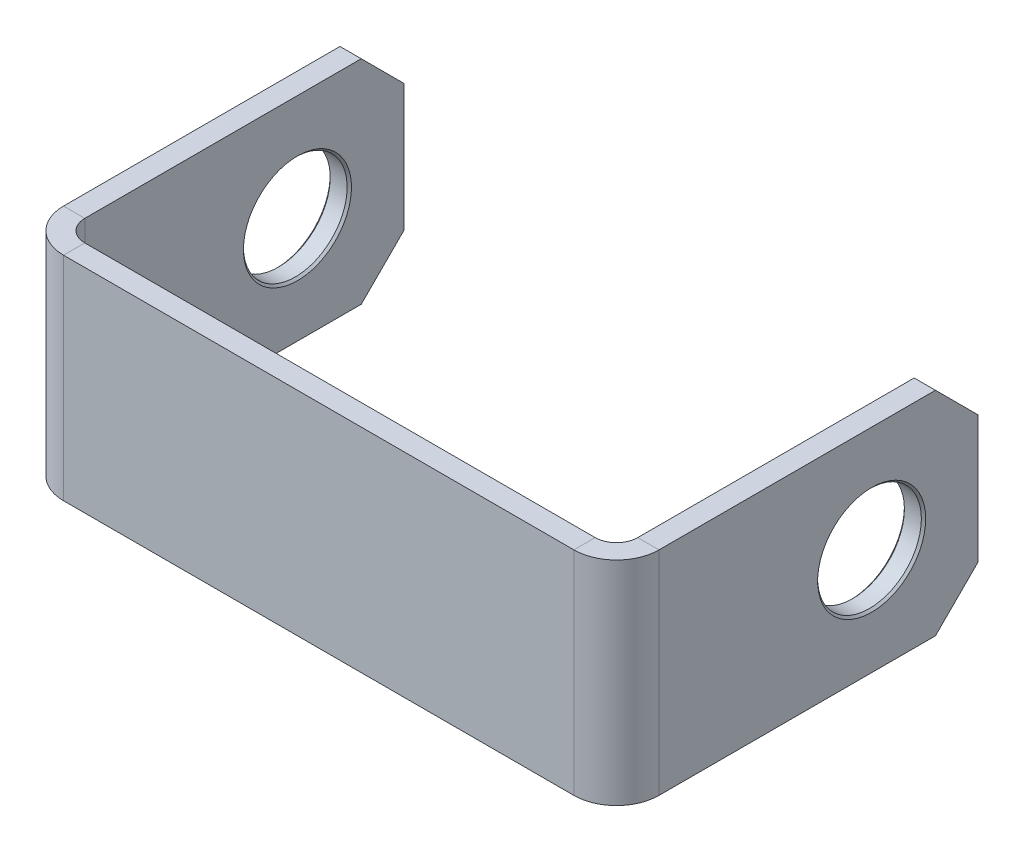
ISO-10303-21;
HEADER;
FILE_DESCRIPTION(('STEP AP214'),'2;1');
FILE_NAME('part.step','',(''),(''),'','','');
FILE_SCHEMA(('AUTOMOTIVE_DESIGN { 1 0 10303 214 1 1 1 1 }'));
ENDSEC;
DATA;
#1=APPLICATION_CONTEXT('core data for automotive mechanical design processes');
#2=APPLICATION_PROTOCOL_DEFINITION('international standard','automotive_design',2000,#1);
#3=PRODUCT_CONTEXT('',#1,'mechanical');
#4=PRODUCT('Part','Part','',(#3));
#5=PRODUCT_RELATED_PRODUCT_CATEGORY('part','',(#4));
#6=PRODUCT_DEFINITION_FORMATION('','',#4);
#7=PRODUCT_DEFINITION_CONTEXT('part definition',#1,'design');
#8=PRODUCT_DEFINITION('design','',#6,#7);
#9=PRODUCT_DEFINITION_SHAPE('','',#8);
#10=(LENGTH_UNIT() NAMED_UNIT(*) SI_UNIT(.MILLI.,.METRE.));
#11=(NAMED_UNIT(*) PLANE_ANGLE_UNIT() SI_UNIT($,.RADIAN.));
#12=(NAMED_UNIT(*) SI_UNIT($,.STERADIAN.) SOLID_ANGLE_UNIT());
#13=UNCERTAINTY_MEASURE_WITH_UNIT(LENGTH_MEASURE(1.E-05),#10,'distance_accuracy_value','');
#14=(GEOMETRIC_REPRESENTATION_CONTEXT(3) GLOBAL_UNCERTAINTY_ASSIGNED_CONTEXT((#13)) GLOBAL_UNIT_ASSIGNED_CONTEXT((#10,
#11,#12)) REPRESENTATION_CONTEXT('',''));
#15=CARTESIAN_POINT('',(0.,0.,0.));
#16=DIRECTION('',(0.,0.,1.));
#17=DIRECTION('',(1.,0.,0.));
#18=AXIS2_PLACEMENT_3D('',#15,#16,#17);
#19=CARTESIAN_POINT('',(5.99999999999999,0.,-0.5));
#20=DIRECTION('',(0.,-1.,0.));
#21=DIRECTION('',(0.,0.,-1.));
#22=AXIS2_PLACEMENT_3D('',#19,#20,#21);
#23=PLANE('',#22);
#24=DIRECTION('',(0.,0.,1.));
#25=VECTOR('',#24,1.);
#26=CARTESIAN_POINT('',(6.,0.,0.5));
#27=LINE('',#26,#25);
#28=CARTESIAN_POINT('',(6.,0.,0.));
#29=VERTEX_POINT('',#28);
#30=CARTESIAN_POINT('',(6.,0.,0.5));
#31=VERTEX_POINT('',#30);
#32=EDGE_CURVE('E270',#29,#31,#27,.T.);
#33=ORIENTED_EDGE('',*,*,#32,.F.);
#34=CARTESIAN_POINT('',(5.99999999999999,0.,-0.5));
#35=DIRECTION('',(0.,-1.,0.));
#36=DIRECTION('',(0.,0.,-1.));
#37=AXIS2_PLACEMENT_3D('',#34,#35,#36);
#38=CIRCLE('',#37,0.5);
#39=CARTESIAN_POINT('',(6.5,0.,-0.5));
#40=VERTEX_POINT('',#39);
#41=EDGE_CURVE('E217',#29,#40,#38,.F.);
#42=ORIENTED_EDGE('',*,*,#41,.T.);
#43=DIRECTION('',(1.,0.,0.));
#44=VECTOR('',#43,1.);
#45=CARTESIAN_POINT('',(6.99999999999999,0.,-0.5));
#46=LINE('',#45,#44);
#47=CARTESIAN_POINT('',(6.99999999999999,0.,-0.5));
#48=VERTEX_POINT('',#47);
#49=EDGE_CURVE('E158',#40,#48,#46,.T.);
#50=ORIENTED_EDGE('',*,*,#49,.T.);
#51=CARTESIAN_POINT('',(5.99999999999999,0.,-0.5));
#52=DIRECTION('',(0.,1.,0.));
#53=DIRECTION('',(0.,0.,-1.));
#54=AXIS2_PLACEMENT_3D('',#51,#52,#53);
#55=CIRCLE('',#54,1.);
#56=EDGE_CURVE('E178',#31,#48,#55,.T.);
#57=ORIENTED_EDGE('',*,*,#56,.F.);
#58=EDGE_LOOP('',(#33,#42,#50,#57));
#59=FACE_BOUND('',#58,.T.);
#60=ADVANCED_FACE('F32',(#59),#23,.T.);
#61=CARTESIAN_POINT('',(6.99999999999999,0.,-0.5));
#62=DIRECTION('',(0.,1.,0.));
#63=DIRECTION('',(0.,0.,-1.));
#64=AXIS2_PLACEMENT_3D('',#61,#62,#63);
#65=PLANE('',#64);
#66=DIRECTION('',(0.,0.,1.));
#67=VECTOR('',#66,1.);
#68=CARTESIAN_POINT('',(6.5,0.,-0.5));
#69=LINE('',#68,#67);
#70=CARTESIAN_POINT('',(6.5,0.,-7.));
#71=VERTEX_POINT('',#70);
#72=EDGE_CURVE('E252',#40,#71,#69,.F.);
#73=ORIENTED_EDGE('',*,*,#72,.T.);
#74=DIRECTION('',(-1.,0.,0.));
#75=VECTOR('',#74,1.);
#76=CARTESIAN_POINT('',(7.,0.,-7.));
#77=LINE('',#76,#75);
#78=CARTESIAN_POINT('',(7.,0.,-7.));
#79=VERTEX_POINT('',#78);
#80=EDGE_CURVE('E272',#71,#79,#77,.F.);
#81=ORIENTED_EDGE('',*,*,#80,.T.);
#82=DIRECTION('',(0.,0.,-1.));
#83=VECTOR('',#82,1.);
#84=CARTESIAN_POINT('',(6.99999999999999,0.,-0.5));
#85=LINE('',#84,#83);
#86=EDGE_CURVE('E243',#48,#79,#85,.T.);
#87=ORIENTED_EDGE('',*,*,#86,.F.);
#88=ORIENTED_EDGE('',*,*,#49,.F.);
#89=EDGE_LOOP('',(#73,#81,#87,#88));
#90=FACE_BOUND('',#89,.T.);
#91=ADVANCED_FACE('F343',(#90),#65,.F.);
#92=CARTESIAN_POINT('',(7.,5.,-8.));
#93=DIRECTION('',(0.,0.,-1.));
#94=DIRECTION('',(0.,-1.,0.));
#95=AXIS2_PLACEMENT_3D('',#92,#93,#94);
#96=PLANE('',#95);
#97=DIRECTION('',(0.,-1.,0.));
#98=VECTOR('',#97,1.);
#99=CARTESIAN_POINT('',(7.,5.,-8.));
#100=LINE('',#99,#98);
#101=CARTESIAN_POINT('',(7.,4.,-8.));
#102=VERTEX_POINT('',#101);
#103=CARTESIAN_POINT('',(7.,1.,-8.));
#104=VERTEX_POINT('',#103);
#105=EDGE_CURVE('E169',#102,#104,#100,.T.);
#106=ORIENTED_EDGE('',*,*,#105,.T.);
#107=DIRECTION('',(-1.,0.,0.));
#108=VECTOR('',#107,1.);
#109=CARTESIAN_POINT('',(7.,1.,-8.));
#110=LINE('',#109,#108);
#111=CARTESIAN_POINT('',(6.5,1.,-8.));
#112=VERTEX_POINT('',#111);
#113=EDGE_CURVE('E282',#104,#112,#110,.T.);
#114=ORIENTED_EDGE('',*,*,#113,.T.);
#115=DIRECTION('',(0.,1.,0.));
#116=VECTOR('',#115,1.);
#117=CARTESIAN_POINT('',(6.5,5.,-8.));
#118=LINE('',#117,#116);
#119=CARTESIAN_POINT('',(6.5,4.,-8.));
#120=VERTEX_POINT('',#119);
#121=EDGE_CURVE('E249',#120,#112,#118,.F.);
#122=ORIENTED_EDGE('',*,*,#121,.F.);
#123=DIRECTION('',(1.,0.,0.));
#124=VECTOR('',#123,1.);
#125=CARTESIAN_POINT('',(7.,4.,-8.));
#126=LINE('',#125,#124);
#127=EDGE_CURVE('E279',#120,#102,#126,.T.);
#128=ORIENTED_EDGE('',*,*,#127,.T.);
#129=EDGE_LOOP('',(#106,#114,#122,#128));
#130=FACE_BOUND('',#129,.T.);
#131=ADVANCED_FACE('F350',(#130),#96,.T.);
#132=CARTESIAN_POINT('',(6.99999999999999,5.,-0.5));
#133=DIRECTION('',(0.,1.,0.));
#134=DIRECTION('',(0.,0.,-1.));
#135=AXIS2_PLACEMENT_3D('',#132,#133,#134);
#136=PLANE('',#135);
#137=DIRECTION('',(0.,0.,-1.));
#138=VECTOR('',#137,1.);
#139=CARTESIAN_POINT('',(6.99999999999999,5.,-0.5));
#140=LINE('',#139,#138);
#141=CARTESIAN_POINT('',(6.99999999999999,5.,-0.5));
#142=VERTEX_POINT('',#141);
#143=CARTESIAN_POINT('',(7.,5.,-6.99999999999999));
#144=VERTEX_POINT('',#143);
#145=EDGE_CURVE('E150',#142,#144,#140,.T.);
#146=ORIENTED_EDGE('',*,*,#145,.T.);
#147=DIRECTION('',(-1.,0.,0.));
#148=VECTOR('',#147,1.);
#149=CARTESIAN_POINT('',(7.,5.,-7.));
#150=LINE('',#149,#148);
#151=CARTESIAN_POINT('',(6.5,5.,-7.));
#152=VERTEX_POINT('',#151);
#153=EDGE_CURVE('E288',#144,#152,#150,.T.);
#154=ORIENTED_EDGE('',*,*,#153,.T.);
#155=DIRECTION('',(0.,0.,1.));
#156=VECTOR('',#155,1.);
#157=CARTESIAN_POINT('',(6.5,5.,-0.5));
#158=LINE('',#157,#156);
#159=CARTESIAN_POINT('',(6.5,5.,-0.5));
#160=VERTEX_POINT('',#159);
#161=EDGE_CURVE('E153',#160,#152,#158,.F.);
#162=ORIENTED_EDGE('',*,*,#161,.F.);
#163=DIRECTION('',(1.,0.,0.));
#164=VECTOR('',#163,1.);
#165=CARTESIAN_POINT('',(6.99999999999999,5.,-0.5));
#166=LINE('',#165,#164);
#167=EDGE_CURVE('E147',#160,#142,#166,.T.);
#168=ORIENTED_EDGE('',*,*,#167,.T.);
#169=EDGE_LOOP('',(#146,#154,#162,#168));
#170=FACE_BOUND('',#169,.T.);
#171=ADVANCED_FACE('F149',(#170),#136,.T.);
#172=CARTESIAN_POINT('',(5.99999999999999,5.,-0.5));
#173=DIRECTION('',(0.,-1.,0.));
#174=DIRECTION('',(0.,0.,-1.));
#175=AXIS2_PLACEMENT_3D('',#172,#173,#174);
#176=PLANE('',#175);
#177=ORIENTED_EDGE('',*,*,#167,.F.);
#178=CARTESIAN_POINT('',(5.99999999999999,5.,-0.5));
#179=DIRECTION('',(0.,-1.,0.));
#180=DIRECTION('',(0.,0.,-1.));
#181=AXIS2_PLACEMENT_3D('',#178,#179,#180);
#182=CIRCLE('',#181,0.5);
#183=CARTESIAN_POINT('',(6.,5.,0.));
#184=VERTEX_POINT('',#183);
#185=EDGE_CURVE('E237',#184,#160,#182,.F.);
#186=ORIENTED_EDGE('',*,*,#185,.F.);
#187=DIRECTION('',(0.,0.,1.));
#188=VECTOR('',#187,1.);
#189=CARTESIAN_POINT('',(6.,5.,0.5));
#190=LINE('',#189,#188);
#191=CARTESIAN_POINT('',(6.,5.,0.5));
#192=VERTEX_POINT('',#191);
#193=EDGE_CURVE('E159',#184,#192,#190,.T.);
#194=ORIENTED_EDGE('',*,*,#193,.T.);
#195=CARTESIAN_POINT('',(5.99999999999999,5.,-0.5));
#196=DIRECTION('',(0.,1.,0.));
#197=DIRECTION('',(0.,0.,-1.));
#198=AXIS2_PLACEMENT_3D('',#195,#196,#197);
#199=CIRCLE('',#198,1.);
#200=EDGE_CURVE('E172',#192,#142,#199,.T.);
#201=ORIENTED_EDGE('',*,*,#200,.T.);
#202=EDGE_LOOP('',(#177,#186,#194,#201));
#203=FACE_BOUND('',#202,.T.);
#204=ADVANCED_FACE('F173',(#203),#176,.F.);
#205=CARTESIAN_POINT('',(-6.,5.,0.5));
#206=DIRECTION('',(0.,1.,0.));
#207=DIRECTION('',(1.,0.,0.));
#208=AXIS2_PLACEMENT_3D('',#205,#206,#207);
#209=PLANE('',#208);
#210=ORIENTED_EDGE('',*,*,#193,.F.);
#211=DIRECTION('',(-1.,0.,0.));
#212=VECTOR('',#211,1.);
#213=CARTESIAN_POINT('',(-6.,5.,0.));
#214=LINE('',#213,#212);
#215=CARTESIAN_POINT('',(-6.,5.,0.));
#216=VERTEX_POINT('',#215);
#217=EDGE_CURVE('E218',#216,#184,#214,.F.);
#218=ORIENTED_EDGE('',*,*,#217,.F.);
#219=DIRECTION('',(0.,0.,1.));
#220=VECTOR('',#219,1.);
#221=CARTESIAN_POINT('',(-6.,5.,0.5));
#222=LINE('',#221,#220);
#223=CARTESIAN_POINT('',(-6.,5.,0.5));
#224=VERTEX_POINT('',#223);
#225=EDGE_CURVE('E266',#216,#224,#222,.T.);
#226=ORIENTED_EDGE('',*,*,#225,.T.);
#227=DIRECTION('',(1.,0.,0.));
#228=VECTOR('',#227,1.);
#229=CARTESIAN_POINT('',(-6.,5.,0.5));
#230=LINE('',#229,#228);
#231=EDGE_CURVE('E192',#224,#192,#230,.T.);
#232=ORIENTED_EDGE('',*,*,#231,.T.);
#233=EDGE_LOOP('',(#210,#218,#226,#232));
#234=FACE_BOUND('',#233,.T.);
#235=ADVANCED_FACE('F387',(#234),#209,.T.);
#236=CARTESIAN_POINT('',(-5.99999999999999,5.,-0.5));
#237=DIRECTION('',(0.,-1.,0.));
#238=DIRECTION('',(0.,0.,-1.));
#239=AXIS2_PLACEMENT_3D('',#236,#237,#238);
#240=PLANE('',#239);
#241=ORIENTED_EDGE('',*,*,#225,.F.);
#242=CARTESIAN_POINT('',(-5.99999999999999,5.,-0.5));
#243=DIRECTION('',(0.,-1.,0.));
#244=DIRECTION('',(0.,0.,-1.));
#245=AXIS2_PLACEMENT_3D('',#242,#243,#244);
#246=CIRCLE('',#245,0.500000000000002);
#247=CARTESIAN_POINT('',(-6.5,5.,-0.5));
#248=VERTEX_POINT('',#247);
#249=EDGE_CURVE('E234',#248,#216,#246,.F.);
#250=ORIENTED_EDGE('',*,*,#249,.F.);
#251=DIRECTION('',(-1.,0.,0.));
#252=VECTOR('',#251,1.);
#253=CARTESIAN_POINT('',(-7.,5.,-0.5));
#254=LINE('',#253,#252);
#255=CARTESIAN_POINT('',(-7.,5.,-0.5));
#256=VERTEX_POINT('',#255);
#257=EDGE_CURVE('E263',#248,#256,#254,.T.);
#258=ORIENTED_EDGE('',*,*,#257,.T.);
#259=CARTESIAN_POINT('',(-5.99999999999999,5.,-0.5));
#260=DIRECTION('',(0.,1.,0.));
#261=DIRECTION('',(0.,0.,-1.));
#262=AXIS2_PLACEMENT_3D('',#259,#260,#261);
#263=CIRCLE('',#262,1.);
#264=EDGE_CURVE('E210',#256,#224,#263,.T.);
#265=ORIENTED_EDGE('',*,*,#264,.T.);
#266=EDGE_LOOP('',(#241,#250,#258,#265));
#267=FACE_BOUND('',#266,.T.);
#268=ADVANCED_FACE('F330',(#267),#240,.F.);
#269=CARTESIAN_POINT('',(-7.,5.,-8.));
#270=DIRECTION('',(0.,1.,0.));
#271=DIRECTION('',(0.,0.,1.));
#272=AXIS2_PLACEMENT_3D('',#269,#270,#271);
#273=PLANE('',#272);
#274=DIRECTION('',(0.,0.,-1.));
#275=VECTOR('',#274,1.);
#276=CARTESIAN_POINT('',(-6.5,5.,-8.));
#277=LINE('',#276,#275);
#278=CARTESIAN_POINT('',(-6.5,5.,-7.));
#279=VERTEX_POINT('',#278);
#280=EDGE_CURVE('E222',#279,#248,#277,.F.);
#281=ORIENTED_EDGE('',*,*,#280,.F.);
#282=DIRECTION('',(-1.,0.,0.));
#283=VECTOR('',#282,1.);
#284=CARTESIAN_POINT('',(-7.,5.,-7.));
#285=LINE('',#284,#283);
#286=CARTESIAN_POINT('',(-7.,5.,-7.));
#287=VERTEX_POINT('',#286);
#288=EDGE_CURVE('E11',#279,#287,#285,.T.);
#289=ORIENTED_EDGE('',*,*,#288,.T.);
#290=DIRECTION('',(0.,0.,1.));
#291=VECTOR('',#290,1.);
#292=CARTESIAN_POINT('',(-7.,5.,-8.));
#293=LINE('',#292,#291);
#294=EDGE_CURVE('E202',#287,#256,#293,.T.);
#295=ORIENTED_EDGE('',*,*,#294,.T.);
#296=ORIENTED_EDGE('',*,*,#257,.F.);
#297=EDGE_LOOP('',(#281,#289,#295,#296));
#298=FACE_BOUND('',#297,.T.);
#299=ADVANCED_FACE('F325',(#298),#273,.T.);
#300=CARTESIAN_POINT('',(-7.,5.,-8.));
#301=DIRECTION('',(0.,0.,1.));
#302=DIRECTION('',(0.,-1.,0.));
#303=AXIS2_PLACEMENT_3D('',#300,#301,#302);
#304=PLANE('',#303);
#305=DIRECTION('',(0.,1.,0.));
#306=VECTOR('',#305,1.);
#307=CARTESIAN_POINT('',(-6.5,5.,-8.));
#308=LINE('',#307,#306);
#309=CARTESIAN_POINT('',(-6.5,4.,-8.));
#310=VERTEX_POINT('',#309);
#311=CARTESIAN_POINT('',(-6.5,1.,-8.));
#312=VERTEX_POINT('',#311);
#313=EDGE_CURVE('E235',#310,#312,#308,.F.);
#314=ORIENTED_EDGE('',*,*,#313,.T.);
#315=DIRECTION('',(1.,0.,0.));
#316=VECTOR('',#315,1.);
#317=CARTESIAN_POINT('',(-7.,1.,-8.));
#318=LINE('',#317,#316);
#319=CARTESIAN_POINT('',(-7.,1.,-8.));
#320=VERTEX_POINT('',#319);
#321=EDGE_CURVE('E292',#312,#320,#318,.F.);
#322=ORIENTED_EDGE('',*,*,#321,.T.);
#323=DIRECTION('',(0.,-1.,0.));
#324=VECTOR('',#323,1.);
#325=CARTESIAN_POINT('',(-7.,5.,-8.));
#326=LINE('',#325,#324);
#327=CARTESIAN_POINT('',(-7.,4.,-8.));
#328=VERTEX_POINT('',#327);
#329=EDGE_CURVE('E204',#328,#320,#326,.T.);
#330=ORIENTED_EDGE('',*,*,#329,.F.);
#331=DIRECTION('',(-1.,0.,0.));
#332=VECTOR('',#331,1.);
#333=CARTESIAN_POINT('',(-7.,4.,-8.));
#334=LINE('',#333,#332);
#335=EDGE_CURVE('E290',#328,#310,#334,.F.);
#336=ORIENTED_EDGE('',*,*,#335,.T.);
#337=EDGE_LOOP('',(#314,#322,#330,#336));
#338=FACE_BOUND('',#337,.T.);
#339=ADVANCED_FACE('F305',(#338),#304,.F.);
#340=CARTESIAN_POINT('',(-7.,0.,-8.));
#341=DIRECTION('',(0.,1.,0.));
#342=DIRECTION('',(0.,0.,1.));
#343=AXIS2_PLACEMENT_3D('',#340,#341,#342);
#344=PLANE('',#343);
#345=DIRECTION('',(0.,0.,1.));
#346=VECTOR('',#345,1.);
#347=CARTESIAN_POINT('',(-7.,0.,-8.));
#348=LINE('',#347,#346);
#349=CARTESIAN_POINT('',(-7.,0.,-7.));
#350=VERTEX_POINT('',#349);
#351=CARTESIAN_POINT('',(-7.,0.,-0.5));
#352=VERTEX_POINT('',#351);
#353=EDGE_CURVE('E177',#350,#352,#348,.T.);
#354=ORIENTED_EDGE('',*,*,#353,.F.);
#355=DIRECTION('',(-1.,0.,0.));
#356=VECTOR('',#355,1.);
#357=CARTESIAN_POINT('',(-7.,0.,-7.));
#358=LINE('',#357,#356);
#359=CARTESIAN_POINT('',(-6.5,0.,-7.));
#360=VERTEX_POINT('',#359);
#361=EDGE_CURVE('E55',#350,#360,#358,.F.);
#362=ORIENTED_EDGE('',*,*,#361,.T.);
#363=DIRECTION('',(0.,0.,-1.));
#364=VECTOR('',#363,1.);
#365=CARTESIAN_POINT('',(-6.5,0.,-8.));
#366=LINE('',#365,#364);
#367=CARTESIAN_POINT('',(-6.5,0.,-0.5));
#368=VERTEX_POINT('',#367);
#369=EDGE_CURVE('E223',#360,#368,#366,.F.);
#370=ORIENTED_EDGE('',*,*,#369,.T.);
#371=DIRECTION('',(-1.,0.,0.));
#372=VECTOR('',#371,1.);
#373=CARTESIAN_POINT('',(-7.,0.,-0.5));
#374=LINE('',#373,#372);
#375=EDGE_CURVE('E260',#368,#352,#374,.T.);
#376=ORIENTED_EDGE('',*,*,#375,.T.);
#377=EDGE_LOOP('',(#354,#362,#370,#376));
#378=FACE_BOUND('',#377,.T.);
#379=ADVANCED_FACE('F312',(#378),#344,.F.);
#380=CARTESIAN_POINT('',(-5.99999999999999,0.,-0.5));
#381=DIRECTION('',(0.,-1.,0.));
#382=DIRECTION('',(0.,0.,-1.));
#383=AXIS2_PLACEMENT_3D('',#380,#381,#382);
#384=PLANE('',#383);
#385=ORIENTED_EDGE('',*,*,#375,.F.);
#386=CARTESIAN_POINT('',(-5.99999999999999,0.,-0.5));
#387=DIRECTION('',(0.,-1.,0.));
#388=DIRECTION('',(0.,0.,-1.));
#389=AXIS2_PLACEMENT_3D('',#386,#387,#388);
#390=CIRCLE('',#389,0.500000000000002);
#391=CARTESIAN_POINT('',(-6.,0.,0.));
#392=VERTEX_POINT('',#391);
#393=EDGE_CURVE('E231',#368,#392,#390,.F.);
#394=ORIENTED_EDGE('',*,*,#393,.T.);
#395=DIRECTION('',(0.,0.,1.));
#396=VECTOR('',#395,1.);
#397=CARTESIAN_POINT('',(-6.,0.,0.5));
#398=LINE('',#397,#396);
#399=CARTESIAN_POINT('',(-6.,0.,0.5));
#400=VERTEX_POINT('',#399);
#401=EDGE_CURVE('E213',#392,#400,#398,.T.);
#402=ORIENTED_EDGE('',*,*,#401,.T.);
#403=CARTESIAN_POINT('',(-5.99999999999999,0.,-0.5));
#404=DIRECTION('',(0.,1.,0.));
#405=DIRECTION('',(0.,0.,-1.));
#406=AXIS2_PLACEMENT_3D('',#403,#404,#405);
#407=CIRCLE('',#406,1.);
#408=EDGE_CURVE('E207',#352,#400,#407,.T.);
#409=ORIENTED_EDGE('',*,*,#408,.F.);
#410=EDGE_LOOP('',(#385,#394,#402,#409));
#411=FACE_BOUND('',#410,.T.);
#412=ADVANCED_FACE('F316',(#411),#384,.T.);
#413=CARTESIAN_POINT('',(-6.,0.,0.5));
#414=DIRECTION('',(0.,1.,0.));
#415=DIRECTION('',(1.,0.,0.));
#416=AXIS2_PLACEMENT_3D('',#413,#414,#415);
#417=PLANE('',#416);
#418=DIRECTION('',(-1.,0.,0.));
#419=VECTOR('',#418,1.);
#420=CARTESIAN_POINT('',(-6.,0.,0.));
#421=LINE('',#420,#419);
#422=EDGE_CURVE('E227',#392,#29,#421,.F.);
#423=ORIENTED_EDGE('',*,*,#422,.T.);
#424=ORIENTED_EDGE('',*,*,#32,.T.);
#425=DIRECTION('',(1.,0.,0.));
#426=VECTOR('',#425,1.);
#427=CARTESIAN_POINT('',(-6.,0.,0.5));
#428=LINE('',#427,#426);
#429=EDGE_CURVE('E184',#400,#31,#428,.T.);
#430=ORIENTED_EDGE('',*,*,#429,.F.);
#431=ORIENTED_EDGE('',*,*,#401,.F.);
#432=EDGE_LOOP('',(#423,#424,#430,#431));
#433=FACE_BOUND('',#432,.T.);
#434=ADVANCED_FACE('F355',(#433),#417,.F.);
#435=CARTESIAN_POINT('',(-5.99999999999999,5.,-0.5));
#436=DIRECTION('',(0.,-1.,0.));
#437=DIRECTION('',(0.,0.,-1.));
#438=AXIS2_PLACEMENT_3D('',#435,#436,#437);
#439=CYLINDRICAL_SURFACE('',#438,1.);
#440=ORIENTED_EDGE('',*,*,#408,.T.);
#441=DIRECTION('',(0.,-1.,0.));
#442=VECTOR('',#441,1.);
#443=CARTESIAN_POINT('',(-6.,5.,0.5));
#444=LINE('',#443,#442);
#445=EDGE_CURVE('E194',#224,#400,#444,.T.);
#446=ORIENTED_EDGE('',*,*,#445,.F.);
#447=ORIENTED_EDGE('',*,*,#264,.F.);
#448=DIRECTION('',(0.,-1.,0.));
#449=VECTOR('',#448,1.);
#450=CARTESIAN_POINT('',(-7.,5.,-0.5));
#451=LINE('',#450,#449);
#452=EDGE_CURVE('E199',#256,#352,#451,.T.);
#453=ORIENTED_EDGE('',*,*,#452,.T.);
#454=EDGE_LOOP('',(#440,#446,#447,#453));
#455=FACE_BOUND('',#454,.T.);
#456=ADVANCED_FACE('F321',(#455),#439,.T.);
#457=CARTESIAN_POINT('',(-7.,5.,-8.));
#458=DIRECTION('',(1.,0.,0.));
#459=DIRECTION('',(0.,0.,-1.));
#460=AXIS2_PLACEMENT_3D('',#457,#458,#459);
#461=PLANE('',#460);
#462=CARTESIAN_POINT('',(-7.,2.5,-5.5));
#463=DIRECTION('',(-1.,0.,0.));
#464=DIRECTION('',(0.,0.,1.));
#465=AXIS2_PLACEMENT_3D('',#462,#463,#464);
#466=CIRCLE('',#465,1.27);
#467=CARTESIAN_POINT('',(-7.,2.5,-4.23));
#468=VERTEX_POINT('',#467);
#469=EDGE_CURVE('E694',#468,#468,#466,.T.);
#470=ORIENTED_EDGE('',*,*,#469,.F.);
#471=EDGE_LOOP('',(#470));
#472=FACE_BOUND('',#471,.T.);
#473=ORIENTED_EDGE('',*,*,#329,.T.);
#474=DIRECTION('',(0.,0.707106781186547,-0.707106781186549));
#475=VECTOR('',#474,1.);
#476=CARTESIAN_POINT('',(-7.,1.,-8.));
#477=LINE('',#476,#475);
#478=EDGE_CURVE('E297',#320,#350,#477,.F.);
#479=ORIENTED_EDGE('',*,*,#478,.T.);
#480=ORIENTED_EDGE('',*,*,#353,.T.);
#481=ORIENTED_EDGE('',*,*,#452,.F.);
#482=ORIENTED_EDGE('',*,*,#294,.F.);
#483=DIRECTION('',(0.,-0.707106781186549,-0.707106781186546));
#484=VECTOR('',#483,1.);
#485=CARTESIAN_POINT('',(-7.,5.,-7.));
#486=LINE('',#485,#484);
#487=EDGE_CURVE('E295',#287,#328,#486,.T.);
#488=ORIENTED_EDGE('',*,*,#487,.T.);
#489=EDGE_LOOP('',(#473,#479,#480,#481,#482,#488));
#490=FACE_BOUND('',#489,.T.);
#491=ADVANCED_FACE('F310',(#472,#490),#461,.F.);
#492=CARTESIAN_POINT('',(5.99999999999999,5.,-0.5));
#493=DIRECTION('',(0.,-1.,0.));
#494=DIRECTION('',(0.,0.,-1.));
#495=AXIS2_PLACEMENT_3D('',#492,#493,#494);
#496=CYLINDRICAL_SURFACE('',#495,1.);
#497=ORIENTED_EDGE('',*,*,#56,.T.);
#498=DIRECTION('',(0.,-1.,0.));
#499=VECTOR('',#498,1.);
#500=CARTESIAN_POINT('',(6.99999999999999,5.,-0.5));
#501=LINE('',#500,#499);
#502=EDGE_CURVE('E166',#142,#48,#501,.T.);
#503=ORIENTED_EDGE('',*,*,#502,.F.);
#504=ORIENTED_EDGE('',*,*,#200,.F.);
#505=DIRECTION('',(0.,-1.,0.));
#506=VECTOR('',#505,1.);
#507=CARTESIAN_POINT('',(6.,5.,0.5));
#508=LINE('',#507,#506);
#509=EDGE_CURVE('E187',#192,#31,#508,.T.);
#510=ORIENTED_EDGE('',*,*,#509,.T.);
#511=EDGE_LOOP('',(#497,#503,#504,#510));
#512=FACE_BOUND('',#511,.T.);
#513=ADVANCED_FACE('F181',(#512),#496,.T.);
#514=CARTESIAN_POINT('',(-6.,5.,0.5));
#515=DIRECTION('',(0.,0.,-1.));
#516=DIRECTION('',(-1.,0.,0.));
#517=AXIS2_PLACEMENT_3D('',#514,#515,#516);
#518=PLANE('',#517);
#519=ORIENTED_EDGE('',*,*,#429,.T.);
#520=ORIENTED_EDGE('',*,*,#509,.F.);
#521=ORIENTED_EDGE('',*,*,#231,.F.);
#522=ORIENTED_EDGE('',*,*,#445,.T.);
#523=EDGE_LOOP('',(#519,#520,#521,#522));
#524=FACE_BOUND('',#523,.T.);
#525=ADVANCED_FACE('F391',(#524),#518,.F.);
#526=CARTESIAN_POINT('',(6.99999999999999,5.,-0.5));
#527=DIRECTION('',(-1.,0.,0.));
#528=DIRECTION('',(0.,0.,1.));
#529=AXIS2_PLACEMENT_3D('',#526,#527,#528);
#530=PLANE('',#529);
#531=CARTESIAN_POINT('',(7.,2.5,-5.49999999999999));
#532=DIRECTION('',(1.,0.,0.));
#533=DIRECTION('',(0.,0.,-1.));
#534=AXIS2_PLACEMENT_3D('',#531,#532,#533);
#535=CIRCLE('',#534,1.27);
#536=CARTESIAN_POINT('',(7.,2.5,-6.76999999999999));
#537=VERTEX_POINT('',#536);
#538=EDGE_CURVE('E707',#537,#537,#535,.T.);
#539=ORIENTED_EDGE('',*,*,#538,.F.);
#540=EDGE_LOOP('',(#539));
#541=FACE_BOUND('',#540,.T.);
#542=ORIENTED_EDGE('',*,*,#86,.T.);
#543=DIRECTION('',(0.,0.707106781186549,-0.707106781186546));
#544=VECTOR('',#543,1.);
#545=CARTESIAN_POINT('',(7.,0.,-7.));
#546=LINE('',#545,#544);
#547=EDGE_CURVE('E277',#79,#104,#546,.T.);
#548=ORIENTED_EDGE('',*,*,#547,.T.);
#549=ORIENTED_EDGE('',*,*,#105,.F.);
#550=DIRECTION('',(0.,-0.707106781186547,-0.707106781186549));
#551=VECTOR('',#550,1.);
#552=CARTESIAN_POINT('',(7.,4.,-8.));
#553=LINE('',#552,#551);
#554=EDGE_CURVE('E168',#102,#144,#553,.F.);
#555=ORIENTED_EDGE('',*,*,#554,.T.);
#556=ORIENTED_EDGE('',*,*,#145,.F.);
#557=ORIENTED_EDGE('',*,*,#502,.T.);
#558=EDGE_LOOP('',(#542,#548,#549,#555,#556,#557));
#559=FACE_BOUND('',#558,.T.);
#560=ADVANCED_FACE('F164',(#541,#559),#530,.F.);
#561=CARTESIAN_POINT('',(-5.99999999999999,5.,-0.5));
#562=DIRECTION('',(0.,-1.,0.));
#563=DIRECTION('',(0.,0.,-1.));
#564=AXIS2_PLACEMENT_3D('',#561,#562,#563);
#565=CYLINDRICAL_SURFACE('',#564,0.500000000000002);
#566=ORIENTED_EDGE('',*,*,#393,.F.);
#567=DIRECTION('',(0.,-1.,0.));
#568=VECTOR('',#567,1.);
#569=CARTESIAN_POINT('',(-6.5,5.,-0.5));
#570=LINE('',#569,#568);
#571=EDGE_CURVE('E219',#248,#368,#570,.T.);
#572=ORIENTED_EDGE('',*,*,#571,.F.);
#573=ORIENTED_EDGE('',*,*,#249,.T.);
#574=DIRECTION('',(0.,1.,0.));
#575=VECTOR('',#574,1.);
#576=CARTESIAN_POINT('',(-6.,5.,0.));
#577=LINE('',#576,#575);
#578=EDGE_CURVE('E214',#216,#392,#577,.F.);
#579=ORIENTED_EDGE('',*,*,#578,.T.);
#580=EDGE_LOOP('',(#566,#572,#573,#579));
#581=FACE_BOUND('',#580,.T.);
#582=ADVANCED_FACE('F334',(#581),#565,.F.);
#583=CARTESIAN_POINT('',(-6.5,5.,-8.));
#584=DIRECTION('',(1.,0.,0.));
#585=DIRECTION('',(0.,0.,-1.));
#586=AXIS2_PLACEMENT_3D('',#583,#584,#585);
#587=PLANE('',#586);
#588=CARTESIAN_POINT('',(-6.5,2.5,-5.5));
#589=DIRECTION('',(-1.,0.,0.));
#590=DIRECTION('',(0.,0.,1.));
#591=AXIS2_PLACEMENT_3D('',#588,#589,#590);
#592=CIRCLE('',#591,1.27);
#593=CARTESIAN_POINT('',(-6.5,2.5,-4.23));
#594=VERTEX_POINT('',#593);
#595=EDGE_CURVE('E688',#594,#594,#592,.T.);
#596=ORIENTED_EDGE('',*,*,#595,.T.);
#597=EDGE_LOOP('',(#596));
#598=FACE_BOUND('',#597,.T.);
#599=ORIENTED_EDGE('',*,*,#369,.F.);
#600=DIRECTION('',(0.,-0.707106781186547,0.707106781186549));
#601=VECTOR('',#600,1.);
#602=CARTESIAN_POINT('',(-6.5,2.99999999999999,-10.));
#603=LINE('',#602,#601);
#604=EDGE_CURVE('E40',#360,#312,#603,.F.);
#605=ORIENTED_EDGE('',*,*,#604,.T.);
#606=ORIENTED_EDGE('',*,*,#313,.F.);
#607=DIRECTION('',(0.,0.707106781186549,0.707106781186546));
#608=VECTOR('',#607,1.);
#609=CARTESIAN_POINT('',(-6.5,4.5,-7.5));
#610=LINE('',#609,#608);
#611=EDGE_CURVE('E47',#310,#279,#610,.T.);
#612=ORIENTED_EDGE('',*,*,#611,.T.);
#613=ORIENTED_EDGE('',*,*,#280,.T.);
#614=ORIENTED_EDGE('',*,*,#571,.T.);
#615=EDGE_LOOP('',(#599,#605,#606,#612,#613,#614));
#616=FACE_BOUND('',#615,.T.);
#617=ADVANCED_FACE('F301',(#598,#616),#587,.T.);
#618=CARTESIAN_POINT('',(5.99999999999999,5.,-0.5));
#619=DIRECTION('',(0.,-1.,0.));
#620=DIRECTION('',(0.,0.,-1.));
#621=AXIS2_PLACEMENT_3D('',#618,#619,#620);
#622=CYLINDRICAL_SURFACE('',#621,0.5);
#623=ORIENTED_EDGE('',*,*,#41,.F.);
#624=DIRECTION('',(0.,-1.,0.));
#625=VECTOR('',#624,1.);
#626=CARTESIAN_POINT('',(6.,5.,0.));
#627=LINE('',#626,#625);
#628=EDGE_CURVE('E224',#184,#29,#627,.T.);
#629=ORIENTED_EDGE('',*,*,#628,.F.);
#630=ORIENTED_EDGE('',*,*,#185,.T.);
#631=DIRECTION('',(0.,1.,0.));
#632=VECTOR('',#631,1.);
#633=CARTESIAN_POINT('',(6.5,5.,-0.5));
#634=LINE('',#633,#632);
#635=EDGE_CURVE('E228',#160,#40,#634,.F.);
#636=ORIENTED_EDGE('',*,*,#635,.T.);
#637=EDGE_LOOP('',(#623,#629,#630,#636));
#638=FACE_BOUND('',#637,.T.);
#639=ADVANCED_FACE('F381',(#638),#622,.F.);
#640=CARTESIAN_POINT('',(-6.,5.,0.));
#641=DIRECTION('',(0.,0.,-1.));
#642=DIRECTION('',(-1.,0.,0.));
#643=AXIS2_PLACEMENT_3D('',#640,#641,#642);
#644=PLANE('',#643);
#645=ORIENTED_EDGE('',*,*,#422,.F.);
#646=ORIENTED_EDGE('',*,*,#578,.F.);
#647=ORIENTED_EDGE('',*,*,#217,.T.);
#648=ORIENTED_EDGE('',*,*,#628,.T.);
#649=EDGE_LOOP('',(#645,#646,#647,#648));
#650=FACE_BOUND('',#649,.T.);
#651=ADVANCED_FACE('F385',(#650),#644,.T.);
#652=CARTESIAN_POINT('',(6.5,5.,-0.5));
#653=DIRECTION('',(-1.,0.,0.));
#654=DIRECTION('',(0.,0.,1.));
#655=AXIS2_PLACEMENT_3D('',#652,#653,#654);
#656=PLANE('',#655);
#657=CARTESIAN_POINT('',(6.5,2.5,-5.49999999999999));
#658=DIRECTION('',(1.,0.,0.));
#659=DIRECTION('',(0.,0.,-1.));
#660=AXIS2_PLACEMENT_3D('',#657,#658,#659);
#661=CIRCLE('',#660,1.27);
#662=CARTESIAN_POINT('',(6.5,2.5,-6.76999999999999));
#663=VERTEX_POINT('',#662);
#664=EDGE_CURVE('E710',#663,#663,#661,.T.);
#665=ORIENTED_EDGE('',*,*,#664,.T.);
#666=EDGE_LOOP('',(#665));
#667=FACE_BOUND('',#666,.T.);
#668=ORIENTED_EDGE('',*,*,#121,.T.);
#669=DIRECTION('',(0.,-0.707106781186549,0.707106781186546));
#670=VECTOR('',#669,1.);
#671=CARTESIAN_POINT('',(6.5,-0.749999999999992,-6.25000000000001));
#672=LINE('',#671,#670);
#673=EDGE_CURVE('E286',#112,#71,#672,.T.);
#674=ORIENTED_EDGE('',*,*,#673,.T.);
#675=ORIENTED_EDGE('',*,*,#72,.F.);
#676=ORIENTED_EDGE('',*,*,#635,.F.);
#677=ORIENTED_EDGE('',*,*,#161,.T.);
#678=DIRECTION('',(0.,0.707106781186547,0.707106781186549));
#679=VECTOR('',#678,1.);
#680=CARTESIAN_POINT('',(6.5,8.25,-3.74999999999999));
#681=LINE('',#680,#679);
#682=EDGE_CURVE('E284',#152,#120,#681,.F.);
#683=ORIENTED_EDGE('',*,*,#682,.T.);
#684=EDGE_LOOP('',(#668,#674,#675,#676,#677,#683));
#685=FACE_BOUND('',#684,.T.);
#686=ADVANCED_FACE('F372',(#667,#685),#656,.T.);
#687=CARTESIAN_POINT('',(-6.5508,2.5,-5.5));
#688=DIRECTION('',(1.,0.,0.));
#689=DIRECTION('',(0.,0.,-1.));
#690=AXIS2_PLACEMENT_3D('',#687,#688,#689);
#691=CONICAL_SURFACE('',#690,1.2192,0.785398163397448);
#692=ORIENTED_EDGE('',*,*,#595,.F.);
#693=EDGE_LOOP('',(#692));
#694=FACE_BOUND('',#693,.T.);
#695=CARTESIAN_POINT('',(-6.5508,2.5,-5.5));
#696=DIRECTION('',(-1.,0.,0.));
#697=DIRECTION('',(0.,0.,1.));
#698=AXIS2_PLACEMENT_3D('',#695,#696,#697);
#699=CIRCLE('',#698,1.2192);
#700=CARTESIAN_POINT('',(-6.5508,2.5,-4.2808));
#701=VERTEX_POINT('',#700);
#702=EDGE_CURVE('E255',#701,#701,#699,.T.);
#703=ORIENTED_EDGE('',*,*,#702,.T.);
#704=EDGE_LOOP('',(#703));
#705=FACE_BOUND('',#704,.T.);
#706=ADVANCED_FACE('F420',(#694,#705),#691,.F.);
#707=CARTESIAN_POINT('',(-7.,2.5,-5.5));
#708=DIRECTION('',(-1.,0.,0.));
#709=DIRECTION('',(0.,0.,1.));
#710=AXIS2_PLACEMENT_3D('',#707,#708,#709);
#711=CYLINDRICAL_SURFACE('',#710,1.2192);
#712=ORIENTED_EDGE('',*,*,#702,.F.);
#713=EDGE_LOOP('',(#712));
#714=FACE_BOUND('',#713,.T.);
#715=CARTESIAN_POINT('',(-6.9492,2.5,-5.5));
#716=DIRECTION('',(-1.,0.,0.));
#717=DIRECTION('',(0.,0.,1.));
#718=AXIS2_PLACEMENT_3D('',#715,#716,#717);
#719=CIRCLE('',#718,1.2192);
#720=CARTESIAN_POINT('',(-6.9492,2.5,-4.2808));
#721=VERTEX_POINT('',#720);
#722=EDGE_CURVE('E691',#721,#721,#719,.T.);
#723=ORIENTED_EDGE('',*,*,#722,.T.);
#724=EDGE_LOOP('',(#723));
#725=FACE_BOUND('',#724,.T.);
#726=ADVANCED_FACE('F523',(#714,#725),#711,.F.);
#727=CARTESIAN_POINT('',(-7.,2.5,-5.5));
#728=DIRECTION('',(-1.,0.,0.));
#729=DIRECTION('',(0.,0.,1.));
#730=AXIS2_PLACEMENT_3D('',#727,#728,#729);
#731=CONICAL_SURFACE('',#730,1.27,0.785398163397436);
#732=ORIENTED_EDGE('',*,*,#722,.F.);
#733=EDGE_LOOP('',(#732));
#734=FACE_BOUND('',#733,.T.);
#735=ORIENTED_EDGE('',*,*,#469,.T.);
#736=EDGE_LOOP('',(#735));
#737=FACE_BOUND('',#736,.T.);
#738=ADVANCED_FACE('F515',(#734,#737),#731,.F.);
#739=CARTESIAN_POINT('',(6.5508,2.5,-5.49999999999999));
#740=DIRECTION('',(-1.,0.,0.));
#741=DIRECTION('',(0.,0.,1.));
#742=AXIS2_PLACEMENT_3D('',#739,#740,#741);
#743=CONICAL_SURFACE('',#742,1.2192,0.785398163397448);
#744=ORIENTED_EDGE('',*,*,#664,.F.);
#745=EDGE_LOOP('',(#744));
#746=FACE_BOUND('',#745,.T.);
#747=CARTESIAN_POINT('',(6.5508,2.5,-5.49999999999999));
#748=DIRECTION('',(1.,0.,0.));
#749=DIRECTION('',(0.,0.,-1.));
#750=AXIS2_PLACEMENT_3D('',#747,#748,#749);
#751=CIRCLE('',#750,1.2192);
#752=CARTESIAN_POINT('',(6.5508,2.5,-6.71919999999999));
#753=VERTEX_POINT('',#752);
#754=EDGE_CURVE('E701',#753,#753,#751,.T.);
#755=ORIENTED_EDGE('',*,*,#754,.T.);
#756=EDGE_LOOP('',(#755));
#757=FACE_BOUND('',#756,.T.);
#758=ADVANCED_FACE('F507',(#746,#757),#743,.F.);
#759=CARTESIAN_POINT('',(7.,2.5,-5.49999999999999));
#760=DIRECTION('',(1.,0.,0.));
#761=DIRECTION('',(0.,0.,-1.));
#762=AXIS2_PLACEMENT_3D('',#759,#760,#761);
#763=CYLINDRICAL_SURFACE('',#762,1.21919999999999);
#764=ORIENTED_EDGE('',*,*,#754,.F.);
#765=EDGE_LOOP('',(#764));
#766=FACE_BOUND('',#765,.T.);
#767=CARTESIAN_POINT('',(6.94919999999999,2.5,-5.49999999999999));
#768=DIRECTION('',(1.,0.,0.));
#769=DIRECTION('',(0.,0.,-1.));
#770=AXIS2_PLACEMENT_3D('',#767,#768,#769);
#771=CIRCLE('',#770,1.21919999999999);
#772=CARTESIAN_POINT('',(6.9492,2.5,-6.71919999999998));
#773=VERTEX_POINT('',#772);
#774=EDGE_CURVE('E704',#773,#773,#771,.T.);
#775=ORIENTED_EDGE('',*,*,#774,.T.);
#776=EDGE_LOOP('',(#775));
#777=FACE_BOUND('',#776,.T.);
#778=ADVANCED_FACE('F500',(#766,#777),#763,.F.);
#779=CARTESIAN_POINT('',(7.,2.5,-5.49999999999999));
#780=DIRECTION('',(1.,0.,0.));
#781=DIRECTION('',(0.,0.,-1.));
#782=AXIS2_PLACEMENT_3D('',#779,#780,#781);
#783=CONICAL_SURFACE('',#782,1.27,0.785398163397517);
#784=ORIENTED_EDGE('',*,*,#774,.F.);
#785=EDGE_LOOP('',(#784));
#786=FACE_BOUND('',#785,.T.);
#787=ORIENTED_EDGE('',*,*,#538,.T.);
#788=EDGE_LOOP('',(#787));
#789=FACE_BOUND('',#788,.T.);
#790=ADVANCED_FACE('F362',(#786,#789),#783,.F.);
#791=CARTESIAN_POINT('',(7.,0.,-7.));
#792=DIRECTION('',(0.,-0.707106781186546,-0.707106781186549));
#793=DIRECTION('',(0.,0.707106781186549,-0.707106781186546));
#794=AXIS2_PLACEMENT_3D('',#791,#792,#793);
#795=PLANE('',#794);
#796=ORIENTED_EDGE('',*,*,#673,.F.);
#797=ORIENTED_EDGE('',*,*,#113,.F.);
#798=ORIENTED_EDGE('',*,*,#547,.F.);
#799=ORIENTED_EDGE('',*,*,#80,.F.);
#800=EDGE_LOOP('',(#796,#797,#798,#799));
#801=FACE_BOUND('',#800,.T.);
#802=ADVANCED_FACE('F359',(#801),#795,.T.);
#803=CARTESIAN_POINT('',(7.,4.,-8.));
#804=DIRECTION('',(0.,-0.707106781186549,0.707106781186547));
#805=DIRECTION('',(0.,-0.707106781186547,-0.707106781186549));
#806=AXIS2_PLACEMENT_3D('',#803,#804,#805);
#807=PLANE('',#806);
#808=ORIENTED_EDGE('',*,*,#682,.F.);
#809=ORIENTED_EDGE('',*,*,#153,.F.);
#810=ORIENTED_EDGE('',*,*,#554,.F.);
#811=ORIENTED_EDGE('',*,*,#127,.F.);
#812=EDGE_LOOP('',(#808,#809,#810,#811));
#813=FACE_BOUND('',#812,.T.);
#814=ADVANCED_FACE('F341',(#813),#807,.F.);
#815=CARTESIAN_POINT('',(-7.,1.,-8.));
#816=DIRECTION('',(0.,0.707106781186549,0.707106781186547));
#817=DIRECTION('',(0.,-0.707106781186547,0.707106781186549));
#818=AXIS2_PLACEMENT_3D('',#815,#816,#817);
#819=PLANE('',#818);
#820=ORIENTED_EDGE('',*,*,#604,.F.);
#821=ORIENTED_EDGE('',*,*,#361,.F.);
#822=ORIENTED_EDGE('',*,*,#478,.F.);
#823=ORIENTED_EDGE('',*,*,#321,.F.);
#824=EDGE_LOOP('',(#820,#821,#822,#823));
#825=FACE_BOUND('',#824,.T.);
#826=ADVANCED_FACE('F308',(#825),#819,.F.);
#827=CARTESIAN_POINT('',(-7.,5.,-7.));
#828=DIRECTION('',(0.,0.707106781186546,-0.707106781186549));
#829=DIRECTION('',(0.,0.707106781186549,0.707106781186546));
#830=AXIS2_PLACEMENT_3D('',#827,#828,#829);
#831=PLANE('',#830);
#832=ORIENTED_EDGE('',*,*,#611,.F.);
#833=ORIENTED_EDGE('',*,*,#335,.F.);
#834=ORIENTED_EDGE('',*,*,#487,.F.);
#835=ORIENTED_EDGE('',*,*,#288,.F.);
#836=EDGE_LOOP('',(#832,#833,#834,#835));
#837=FACE_BOUND('',#836,.T.);
#838=ADVANCED_FACE('F34',(#837),#831,.T.);
#839=CLOSED_SHELL('',(#60,#91,#131,#171,#204,#235,#268,#299,#339,#379,#412,#434,#456,#491,#513,
#525,#560,#582,#617,#639,#651,#686,#706,#726,#738,#758,#778,#790,#802,#814,#826,#838));
#840=MANIFOLD_SOLID_BREP('B2',#839);
#841=ADVANCED_BREP_SHAPE_REPRESENTATION('',(#18,#840),#14);
#842=SHAPE_DEFINITION_REPRESENTATION(#9,#841);
ENDSEC;
END-ISO-10303-21;
